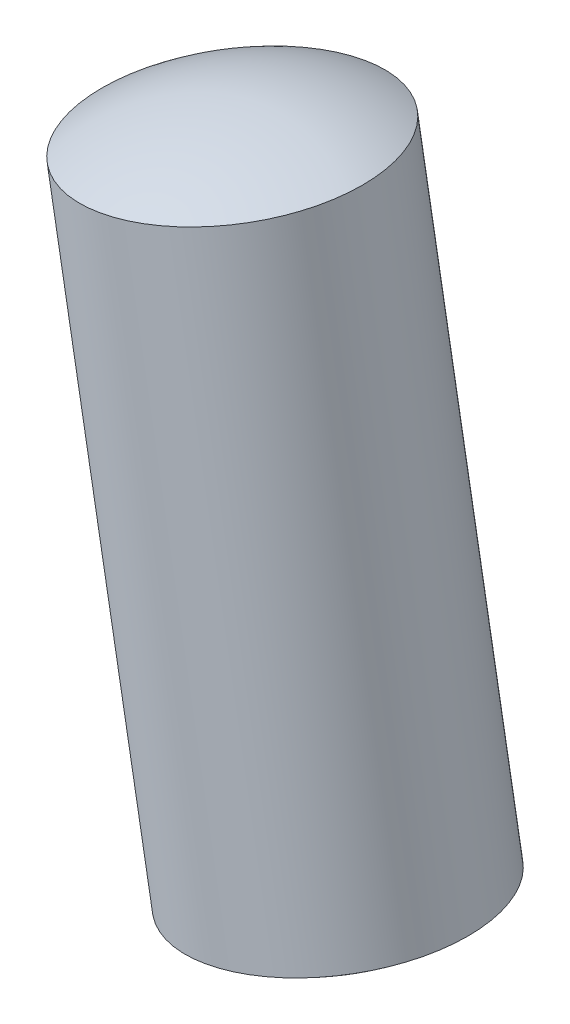
ISO-10303-21;
HEADER;
FILE_DESCRIPTION(('STEP AP214'),'2;1');
FILE_NAME('part.step','',(''),(''),'','','');
FILE_SCHEMA(('AUTOMOTIVE_DESIGN { 1 0 10303 214 1 1 1 1 }'));
ENDSEC;
DATA;
#1=APPLICATION_CONTEXT('core data for automotive mechanical design processes');
#2=APPLICATION_PROTOCOL_DEFINITION('international standard','automotive_design',2000,#1);
#3=PRODUCT_CONTEXT('',#1,'mechanical');
#4=PRODUCT('Part','Part','',(#3));
#5=PRODUCT_RELATED_PRODUCT_CATEGORY('part','',(#4));
#6=PRODUCT_DEFINITION_FORMATION('','',#4);
#7=PRODUCT_DEFINITION_CONTEXT('part definition',#1,'design');
#8=PRODUCT_DEFINITION('design','',#6,#7);
#9=PRODUCT_DEFINITION_SHAPE('','',#8);
#10=(LENGTH_UNIT() NAMED_UNIT(*) SI_UNIT(.MILLI.,.METRE.));
#11=(NAMED_UNIT(*) PLANE_ANGLE_UNIT() SI_UNIT($,.RADIAN.));
#12=(NAMED_UNIT(*) SI_UNIT($,.STERADIAN.) SOLID_ANGLE_UNIT());
#13=UNCERTAINTY_MEASURE_WITH_UNIT(LENGTH_MEASURE(1.E-05),#10,'distance_accuracy_value','');
#14=(GEOMETRIC_REPRESENTATION_CONTEXT(3) GLOBAL_UNCERTAINTY_ASSIGNED_CONTEXT((#13)) GLOBAL_UNIT_ASSIGNED_CONTEXT((#10,
#11,#12)) REPRESENTATION_CONTEXT('',''));
#15=CARTESIAN_POINT('',(0.,0.,0.));
#16=DIRECTION('',(0.,0.,1.));
#17=DIRECTION('',(1.,0.,0.));
#18=AXIS2_PLACEMENT_3D('',#15,#16,#17);
#19=CARTESIAN_POINT('',(3.87752274493661,-21.9734503213881,0.599999999999989));
#20=DIRECTION('',(-0.984784670636092,-0.173779033488406,0.));
#21=DIRECTION('',(0.173779033488407,-0.984784670636092,0.));
#22=AXIS2_PLACEMENT_3D('',#19,#20,#21);
#23=SPHERICAL_SURFACE('',#22,2.);
#24=CARTESIAN_POINT('',(3.87752274493661,-21.9734503213881,0.599999999999989));
#25=DIRECTION('',(-0.173779033488406,0.984784670636092,0.));
#26=DIRECTION('',(0.,0.,-1.));
#27=AXIS2_PLACEMENT_3D('',#24,#25,#26);
#28=SPHERICAL_SURFACE('',#27,2.);
#29=CARTESIAN_POINT('',(4.17851686022878,-23.6791474054448,0.599999999999989));
#30=DIRECTION('',(-0.173779033488406,0.984784670636092,0.));
#31=DIRECTION('',(0.,0.,-1.));
#32=AXIS2_PLACEMENT_3D('',#29,#30,#31);
#33=CIRCLE('',#32,1.);
#34=CARTESIAN_POINT('',(4.17851686022878,-23.6791474054448,-0.400000000000011));
#35=VERTEX_POINT('',#34);
#36=EDGE_CURVE('E11',#35,#35,#33,.T.);
#37=ORIENTED_EDGE('',*,*,#36,.F.);
#38=EDGE_LOOP('',(#37));
#39=FACE_BOUND('',#38,.T.);
#40=ADVANCED_FACE('F17',(#39),#28,.T.);
#41=CARTESIAN_POINT('',(3.68186521180909,-20.8646828512818,0.599999999999989));
#42=DIRECTION('',(-0.984784670636092,-0.173779033488406,0.));
#43=DIRECTION('',(-0.173779033488407,0.984784670636092,0.));
#44=AXIS2_PLACEMENT_3D('',#41,#42,#43);
#45=SPHERICAL_SURFACE('',#44,2.);
#46=CARTESIAN_POINT('',(3.68186521180909,-20.8646828512818,0.599999999999989));
#47=DIRECTION('',(-0.173779033488406,0.984784670636092,0.));
#48=DIRECTION('',(0.,0.,-1.));
#49=AXIS2_PLACEMENT_3D('',#46,#47,#48);
#50=SPHERICAL_SURFACE('',#49,2.);
#51=CARTESIAN_POINT('',(3.38087109651699,-19.1589857672252,0.6));
#52=DIRECTION('',(-0.173779033488406,0.984784670636092,0.));
#53=DIRECTION('',(0.,0.,-1.));
#54=AXIS2_PLACEMENT_3D('',#51,#52,#53);
#55=CIRCLE('',#54,1.);
#56=CARTESIAN_POINT('',(3.38087109651699,-19.1589857672252,-0.4));
#57=VERTEX_POINT('',#56);
#58=EDGE_CURVE('E27',#57,#57,#55,.T.);
#59=ORIENTED_EDGE('',*,*,#58,.T.);
#60=EDGE_LOOP('',(#59));
#61=FACE_BOUND('',#60,.T.);
#62=ADVANCED_FACE('F40',(#61),#50,.T.);
#63=CARTESIAN_POINT('',(3.58028253744486,-20.2890261767801,0.599999999999989));
#64=DIRECTION('',(-0.173779033488406,0.984784670636092,0.));
#65=DIRECTION('',(0.,0.,-1.));
#66=AXIS2_PLACEMENT_3D('',#63,#64,#65);
#67=CYLINDRICAL_SURFACE('',#66,1.);
#68=ORIENTED_EDGE('',*,*,#36,.T.);
#69=EDGE_LOOP('',(#68));
#70=FACE_BOUND('',#69,.T.);
#71=ORIENTED_EDGE('',*,*,#58,.F.);
#72=EDGE_LOOP('',(#71));
#73=FACE_BOUND('',#72,.T.);
#74=ADVANCED_FACE('F19',(#70,#73),#67,.T.);
#75=CLOSED_SHELL('',(#40,#62,#74));
#76=MANIFOLD_SOLID_BREP('B1',#75);
#77=ADVANCED_BREP_SHAPE_REPRESENTATION('',(#18,#76),#14);
#78=SHAPE_DEFINITION_REPRESENTATION(#9,#77);
ENDSEC;
END-ISO-10303-21;
